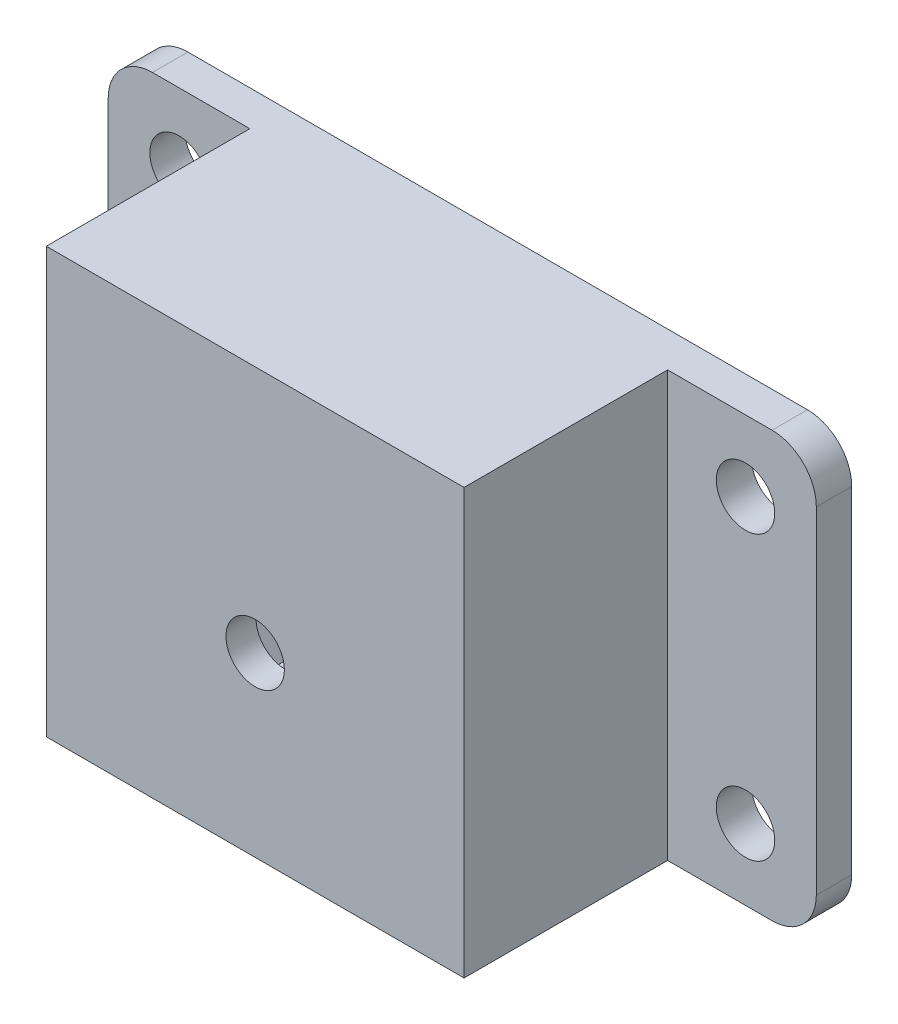
ISO-10303-21;
HEADER;
FILE_DESCRIPTION(('STEP AP214'),'2;1');
FILE_NAME('part.step','',(''),(''),'','','');
FILE_SCHEMA(('AUTOMOTIVE_DESIGN { 1 0 10303 214 1 1 1 1 }'));
ENDSEC;
DATA;
#1=APPLICATION_CONTEXT('core data for automotive mechanical design processes');
#2=APPLICATION_PROTOCOL_DEFINITION('international standard','automotive_design',2000,#1);
#3=PRODUCT_CONTEXT('',#1,'mechanical');
#4=PRODUCT('Part','Part','',(#3));
#5=PRODUCT_RELATED_PRODUCT_CATEGORY('part','',(#4));
#6=PRODUCT_DEFINITION_FORMATION('','',#4);
#7=PRODUCT_DEFINITION_CONTEXT('part definition',#1,'design');
#8=PRODUCT_DEFINITION('design','',#6,#7);
#9=PRODUCT_DEFINITION_SHAPE('','',#8);
#10=(LENGTH_UNIT() NAMED_UNIT(*) SI_UNIT(.MILLI.,.METRE.));
#11=(NAMED_UNIT(*) PLANE_ANGLE_UNIT() SI_UNIT($,.RADIAN.));
#12=(NAMED_UNIT(*) SI_UNIT($,.STERADIAN.) SOLID_ANGLE_UNIT());
#13=UNCERTAINTY_MEASURE_WITH_UNIT(LENGTH_MEASURE(1.E-05),#10,'distance_accuracy_value','');
#14=(GEOMETRIC_REPRESENTATION_CONTEXT(3) GLOBAL_UNCERTAINTY_ASSIGNED_CONTEXT((#13)) GLOBAL_UNIT_ASSIGNED_CONTEXT((#10,
#11,#12)) REPRESENTATION_CONTEXT('',''));
#15=CARTESIAN_POINT('',(0.,0.,0.));
#16=DIRECTION('',(0.,0.,1.));
#17=DIRECTION('',(1.,0.,0.));
#18=AXIS2_PLACEMENT_3D('',#15,#16,#17);
#19=CARTESIAN_POINT('',(-20.2,-14.,13.5));
#20=DIRECTION('',(0.,0.,-1.));
#21=DIRECTION('',(-1.,0.,0.));
#22=AXIS2_PLACEMENT_3D('',#19,#20,#21);
#23=CYLINDRICAL_SURFACE('',#22,1.65);
#24=CARTESIAN_POINT('',(-20.2,-14.,7.5));
#25=DIRECTION('',(0.,0.,1.));
#26=DIRECTION('',(1.,0.,0.));
#27=AXIS2_PLACEMENT_3D('',#24,#25,#26);
#28=CIRCLE('',#27,1.65);
#29=CARTESIAN_POINT('',(-18.55,-14.,7.5));
#30=VERTEX_POINT('',#29);
#31=EDGE_CURVE('E251',#30,#30,#28,.T.);
#32=ORIENTED_EDGE('',*,*,#31,.F.);
#33=EDGE_LOOP('',(#32));
#34=FACE_BOUND('',#33,.T.);
#35=CARTESIAN_POINT('',(-20.2,-14.,9.2));
#36=DIRECTION('',(0.,0.,1.));
#37=DIRECTION('',(1.,0.,0.));
#38=AXIS2_PLACEMENT_3D('',#35,#36,#37);
#39=CIRCLE('',#38,1.65);
#40=CARTESIAN_POINT('',(-18.55,-14.,9.2));
#41=VERTEX_POINT('',#40);
#42=EDGE_CURVE('E254',#41,#41,#39,.T.);
#43=ORIENTED_EDGE('',*,*,#42,.T.);
#44=EDGE_LOOP('',(#43));
#45=FACE_BOUND('',#44,.T.);
#46=ADVANCED_FACE('F39',(#34,#45),#23,.F.);
#47=CARTESIAN_POINT('',(0.,0.,2.));
#48=DIRECTION('',(0.,0.,1.));
#49=DIRECTION('',(1.,0.,0.));
#50=AXIS2_PLACEMENT_3D('',#47,#48,#49);
#51=PLANE('',#50);
#52=DIRECTION('',(-1.,0.,0.));
#53=VECTOR('',#52,1.);
#54=CARTESIAN_POINT('',(0.,0.,2.));
#55=LINE('',#54,#53);
#56=CARTESIAN_POINT('',(-32.,0.,2.));
#57=VERTEX_POINT('',#56);
#58=CARTESIAN_POINT('',(-37.5,0.,2.));
#59=VERTEX_POINT('',#58);
#60=EDGE_CURVE('E324',#57,#59,#55,.T.);
#61=ORIENTED_EDGE('',*,*,#60,.T.);
#62=CARTESIAN_POINT('',(-37.5,-2.5,2.));
#63=DIRECTION('',(0.,0.,1.));
#64=DIRECTION('',(1.,0.,0.));
#65=AXIS2_PLACEMENT_3D('',#62,#63,#64);
#66=CIRCLE('',#65,2.5);
#67=CARTESIAN_POINT('',(-40.,-2.5,2.));
#68=VERTEX_POINT('',#67);
#69=EDGE_CURVE('E11',#59,#68,#66,.T.);
#70=ORIENTED_EDGE('',*,*,#69,.T.);
#71=DIRECTION('',(0.,-1.,0.));
#72=VECTOR('',#71,1.);
#73=CARTESIAN_POINT('',(-40.,0.,2.));
#74=LINE('',#73,#72);
#75=CARTESIAN_POINT('',(-40.,-21.5,2.));
#76=VERTEX_POINT('',#75);
#77=EDGE_CURVE('E323',#68,#76,#74,.T.);
#78=ORIENTED_EDGE('',*,*,#77,.T.);
#79=CARTESIAN_POINT('',(-37.5,-21.5,2.));
#80=DIRECTION('',(0.,0.,1.));
#81=DIRECTION('',(1.,0.,0.));
#82=AXIS2_PLACEMENT_3D('',#79,#80,#81);
#83=CIRCLE('',#82,2.5);
#84=CARTESIAN_POINT('',(-37.5,-24.,2.));
#85=VERTEX_POINT('',#84);
#86=EDGE_CURVE('E47',#76,#85,#83,.T.);
#87=ORIENTED_EDGE('',*,*,#86,.T.);
#88=DIRECTION('',(1.,0.,0.));
#89=VECTOR('',#88,1.);
#90=CARTESIAN_POINT('',(-28.,-24.,2.));
#91=LINE('',#90,#89);
#92=CARTESIAN_POINT('',(-32.,-24.,2.));
#93=VERTEX_POINT('',#92);
#94=EDGE_CURVE('E326',#85,#93,#91,.T.);
#95=ORIENTED_EDGE('',*,*,#94,.T.);
#96=DIRECTION('',(0.,-1.,0.));
#97=VECTOR('',#96,1.);
#98=CARTESIAN_POINT('',(-32.,0.,2.));
#99=LINE('',#98,#97);
#100=EDGE_CURVE('E274',#57,#93,#99,.T.);
#101=ORIENTED_EDGE('',*,*,#100,.F.);
#102=EDGE_LOOP('',(#61,#70,#78,#87,#95,#101));
#103=FACE_BOUND('',#102,.T.);
#104=CARTESIAN_POINT('',(-36.,-20.,2.));
#105=DIRECTION('',(0.,0.,1.));
#106=DIRECTION('',(1.,0.,0.));
#107=AXIS2_PLACEMENT_3D('',#104,#105,#106);
#108=CIRCLE('',#107,1.65);
#109=CARTESIAN_POINT('',(-34.35,-20.,2.));
#110=VERTEX_POINT('',#109);
#111=EDGE_CURVE('E297',#110,#110,#108,.T.);
#112=ORIENTED_EDGE('',*,*,#111,.F.);
#113=EDGE_LOOP('',(#112));
#114=FACE_BOUND('',#113,.T.);
#115=CARTESIAN_POINT('',(-36.,-4.,2.));
#116=DIRECTION('',(0.,0.,1.));
#117=DIRECTION('',(1.,0.,0.));
#118=AXIS2_PLACEMENT_3D('',#115,#116,#117);
#119=CIRCLE('',#118,1.65);
#120=CARTESIAN_POINT('',(-34.35,-4.,2.));
#121=VERTEX_POINT('',#120);
#122=EDGE_CURVE('E303',#121,#121,#119,.T.);
#123=ORIENTED_EDGE('',*,*,#122,.F.);
#124=EDGE_LOOP('',(#123));
#125=FACE_BOUND('',#124,.T.);
#126=ADVANCED_FACE('F400',(#103,#114,#125),#51,.T.);
#127=DIRECTION('',(1.,0.,0.));
#128=VECTOR('',#127,1.);
#129=CARTESIAN_POINT('',(0.,-24.,2.));
#130=LINE('',#129,#128);
#131=CARTESIAN_POINT('',(-8.40000000000001,-24.,2.));
#132=VERTEX_POINT('',#131);
#133=CARTESIAN_POINT('',(-2.49999999999999,-24.,2.));
#134=VERTEX_POINT('',#133);
#135=EDGE_CURVE('E328',#132,#134,#130,.T.);
#136=ORIENTED_EDGE('',*,*,#135,.T.);
#137=CARTESIAN_POINT('',(-2.49999999999999,-21.5,2.));
#138=DIRECTION('',(0.,0.,1.));
#139=DIRECTION('',(1.,0.,0.));
#140=AXIS2_PLACEMENT_3D('',#137,#138,#139);
#141=CIRCLE('',#140,2.5);
#142=CARTESIAN_POINT('',(0.,-21.5,2.));
#143=VERTEX_POINT('',#142);
#144=EDGE_CURVE('E388',#134,#143,#141,.T.);
#145=ORIENTED_EDGE('',*,*,#144,.T.);
#146=DIRECTION('',(0.,1.,0.));
#147=VECTOR('',#146,1.);
#148=CARTESIAN_POINT('',(0.,0.,2.));
#149=LINE('',#148,#147);
#150=CARTESIAN_POINT('',(0.,-2.5,2.));
#151=VERTEX_POINT('',#150);
#152=EDGE_CURVE('E331',#143,#151,#149,.T.);
#153=ORIENTED_EDGE('',*,*,#152,.T.);
#154=CARTESIAN_POINT('',(-2.5,-2.5,2.));
#155=DIRECTION('',(0.,0.,1.));
#156=DIRECTION('',(1.,0.,0.));
#157=AXIS2_PLACEMENT_3D('',#154,#155,#156);
#158=CIRCLE('',#157,2.5);
#159=CARTESIAN_POINT('',(-2.5,0.,2.));
#160=VERTEX_POINT('',#159);
#161=EDGE_CURVE('E386',#151,#160,#158,.T.);
#162=ORIENTED_EDGE('',*,*,#161,.T.);
#163=CARTESIAN_POINT('',(-8.40000000000001,0.,2.));
#164=VERTEX_POINT('',#163);
#165=EDGE_CURVE('E321',#160,#164,#55,.T.);
#166=ORIENTED_EDGE('',*,*,#165,.T.);
#167=DIRECTION('',(0.,1.,0.));
#168=VECTOR('',#167,1.);
#169=CARTESIAN_POINT('',(-8.40000000000001,-24.,2.));
#170=LINE('',#169,#168);
#171=EDGE_CURVE('E267',#132,#164,#170,.T.);
#172=ORIENTED_EDGE('',*,*,#171,.F.);
#173=EDGE_LOOP('',(#136,#145,#153,#162,#166,#172));
#174=FACE_BOUND('',#173,.T.);
#175=CARTESIAN_POINT('',(-4.,-20.,2.));
#176=DIRECTION('',(0.,0.,1.));
#177=DIRECTION('',(1.,0.,0.));
#178=AXIS2_PLACEMENT_3D('',#175,#176,#177);
#179=CIRCLE('',#178,1.65);
#180=CARTESIAN_POINT('',(-2.35,-20.,2.));
#181=VERTEX_POINT('',#180);
#182=EDGE_CURVE('E315',#181,#181,#179,.T.);
#183=ORIENTED_EDGE('',*,*,#182,.F.);
#184=EDGE_LOOP('',(#183));
#185=FACE_BOUND('',#184,.T.);
#186=CARTESIAN_POINT('',(-4.,-4.,2.));
#187=DIRECTION('',(0.,0.,1.));
#188=DIRECTION('',(1.,0.,0.));
#189=AXIS2_PLACEMENT_3D('',#186,#187,#188);
#190=CIRCLE('',#189,1.65);
#191=CARTESIAN_POINT('',(-2.35,-4.,2.));
#192=VERTEX_POINT('',#191);
#193=EDGE_CURVE('E309',#192,#192,#190,.T.);
#194=ORIENTED_EDGE('',*,*,#193,.F.);
#195=EDGE_LOOP('',(#194));
#196=FACE_BOUND('',#195,.T.);
#197=ADVANCED_FACE('F471',(#174,#185,#196),#51,.T.);
#198=CARTESIAN_POINT('',(0.,0.,0.));
#199=DIRECTION('',(0.,0.,1.));
#200=DIRECTION('',(1.,0.,0.));
#201=AXIS2_PLACEMENT_3D('',#198,#199,#200);
#202=PLANE('',#201);
#203=DIRECTION('',(0.,1.,0.));
#204=VECTOR('',#203,1.);
#205=CARTESIAN_POINT('',(0.,0.,0.));
#206=LINE('',#205,#204);
#207=CARTESIAN_POINT('',(0.,-21.5,0.));
#208=VERTEX_POINT('',#207);
#209=CARTESIAN_POINT('',(0.,-2.5,0.));
#210=VERTEX_POINT('',#209);
#211=EDGE_CURVE('E350',#208,#210,#206,.T.);
#212=ORIENTED_EDGE('',*,*,#211,.F.);
#213=CARTESIAN_POINT('',(-2.49999999999999,-21.5,0.));
#214=DIRECTION('',(0.,0.,1.));
#215=DIRECTION('',(1.,0.,0.));
#216=AXIS2_PLACEMENT_3D('',#213,#214,#215);
#217=CIRCLE('',#216,2.5);
#218=CARTESIAN_POINT('',(-2.49999999999999,-24.,0.));
#219=VERTEX_POINT('',#218);
#220=EDGE_CURVE('E379',#208,#219,#217,.F.);
#221=ORIENTED_EDGE('',*,*,#220,.T.);
#222=DIRECTION('',(1.,0.,0.));
#223=VECTOR('',#222,1.);
#224=CARTESIAN_POINT('',(0.,-24.,0.));
#225=LINE('',#224,#223);
#226=CARTESIAN_POINT('',(-12.4,-24.,0.));
#227=VERTEX_POINT('',#226);
#228=EDGE_CURVE('E347',#227,#219,#225,.T.);
#229=ORIENTED_EDGE('',*,*,#228,.F.);
#230=DIRECTION('',(0.,-1.,0.));
#231=VECTOR('',#230,1.);
#232=CARTESIAN_POINT('',(-12.4,-24.,0.));
#233=LINE('',#232,#231);
#234=CARTESIAN_POINT('',(-12.4,-4.,0.));
#235=VERTEX_POINT('',#234);
#236=EDGE_CURVE('E345',#235,#227,#233,.T.);
#237=ORIENTED_EDGE('',*,*,#236,.F.);
#238=DIRECTION('',(1.,0.,0.));
#239=VECTOR('',#238,1.);
#240=CARTESIAN_POINT('',(-12.4,-4.,0.));
#241=LINE('',#240,#239);
#242=CARTESIAN_POINT('',(-28.,-4.,0.));
#243=VERTEX_POINT('',#242);
#244=EDGE_CURVE('E343',#243,#235,#241,.T.);
#245=ORIENTED_EDGE('',*,*,#244,.F.);
#246=DIRECTION('',(0.,1.,0.));
#247=VECTOR('',#246,1.);
#248=CARTESIAN_POINT('',(-28.,-4.,0.));
#249=LINE('',#248,#247);
#250=CARTESIAN_POINT('',(-28.,-24.,0.));
#251=VERTEX_POINT('',#250);
#252=EDGE_CURVE('E341',#251,#243,#249,.T.);
#253=ORIENTED_EDGE('',*,*,#252,.F.);
#254=DIRECTION('',(1.,0.,0.));
#255=VECTOR('',#254,1.);
#256=CARTESIAN_POINT('',(-28.,-24.,0.));
#257=LINE('',#256,#255);
#258=CARTESIAN_POINT('',(-37.5,-24.,0.));
#259=VERTEX_POINT('',#258);
#260=EDGE_CURVE('E339',#259,#251,#257,.T.);
#261=ORIENTED_EDGE('',*,*,#260,.F.);
#262=CARTESIAN_POINT('',(-37.5,-21.5,0.));
#263=DIRECTION('',(0.,0.,1.));
#264=DIRECTION('',(1.,0.,0.));
#265=AXIS2_PLACEMENT_3D('',#262,#263,#264);
#266=CIRCLE('',#265,2.5);
#267=CARTESIAN_POINT('',(-40.,-21.5,0.));
#268=VERTEX_POINT('',#267);
#269=EDGE_CURVE('E373',#259,#268,#266,.F.);
#270=ORIENTED_EDGE('',*,*,#269,.T.);
#271=DIRECTION('',(0.,-1.,0.));
#272=VECTOR('',#271,1.);
#273=CARTESIAN_POINT('',(-40.,0.,0.));
#274=LINE('',#273,#272);
#275=CARTESIAN_POINT('',(-40.,-2.5,0.));
#276=VERTEX_POINT('',#275);
#277=EDGE_CURVE('E337',#276,#268,#274,.T.);
#278=ORIENTED_EDGE('',*,*,#277,.F.);
#279=CARTESIAN_POINT('',(-37.5,-2.5,0.));
#280=DIRECTION('',(0.,0.,1.));
#281=DIRECTION('',(1.,0.,0.));
#282=AXIS2_PLACEMENT_3D('',#279,#280,#281);
#283=CIRCLE('',#282,2.5);
#284=CARTESIAN_POINT('',(-37.5,0.,0.));
#285=VERTEX_POINT('',#284);
#286=EDGE_CURVE('E375',#276,#285,#283,.F.);
#287=ORIENTED_EDGE('',*,*,#286,.T.);
#288=DIRECTION('',(-1.,0.,0.));
#289=VECTOR('',#288,1.);
#290=CARTESIAN_POINT('',(0.,0.,0.));
#291=LINE('',#290,#289);
#292=CARTESIAN_POINT('',(-2.5,0.,0.));
#293=VERTEX_POINT('',#292);
#294=EDGE_CURVE('E318',#293,#285,#291,.T.);
#295=ORIENTED_EDGE('',*,*,#294,.F.);
#296=CARTESIAN_POINT('',(-2.5,-2.5,0.));
#297=DIRECTION('',(0.,0.,1.));
#298=DIRECTION('',(1.,0.,0.));
#299=AXIS2_PLACEMENT_3D('',#296,#297,#298);
#300=CIRCLE('',#299,2.5);
#301=EDGE_CURVE('E377',#293,#210,#300,.F.);
#302=ORIENTED_EDGE('',*,*,#301,.T.);
#303=EDGE_LOOP('',(#212,#221,#229,#237,#245,#253,#261,#270,#278,#287,#295,#302));
#304=FACE_BOUND('',#303,.T.);
#305=CARTESIAN_POINT('',(-4.,-20.,0.));
#306=DIRECTION('',(0.,0.,1.));
#307=DIRECTION('',(1.,0.,0.));
#308=AXIS2_PLACEMENT_3D('',#305,#306,#307);
#309=CIRCLE('',#308,1.65);
#310=CARTESIAN_POINT('',(-2.35,-20.,0.));
#311=VERTEX_POINT('',#310);
#312=EDGE_CURVE('E312',#311,#311,#309,.T.);
#313=ORIENTED_EDGE('',*,*,#312,.T.);
#314=EDGE_LOOP('',(#313));
#315=FACE_BOUND('',#314,.T.);
#316=CARTESIAN_POINT('',(-4.,-4.,0.));
#317=DIRECTION('',(0.,0.,1.));
#318=DIRECTION('',(1.,0.,0.));
#319=AXIS2_PLACEMENT_3D('',#316,#317,#318);
#320=CIRCLE('',#319,1.65);
#321=CARTESIAN_POINT('',(-2.35,-4.,0.));
#322=VERTEX_POINT('',#321);
#323=EDGE_CURVE('E306',#322,#322,#320,.T.);
#324=ORIENTED_EDGE('',*,*,#323,.T.);
#325=EDGE_LOOP('',(#324));
#326=FACE_BOUND('',#325,.T.);
#327=CARTESIAN_POINT('',(-36.,-4.,0.));
#328=DIRECTION('',(0.,0.,1.));
#329=DIRECTION('',(1.,0.,0.));
#330=AXIS2_PLACEMENT_3D('',#327,#328,#329);
#331=CIRCLE('',#330,1.65);
#332=CARTESIAN_POINT('',(-34.35,-4.,0.));
#333=VERTEX_POINT('',#332);
#334=EDGE_CURVE('E300',#333,#333,#331,.T.);
#335=ORIENTED_EDGE('',*,*,#334,.T.);
#336=EDGE_LOOP('',(#335));
#337=FACE_BOUND('',#336,.T.);
#338=CARTESIAN_POINT('',(-36.,-20.,0.));
#339=DIRECTION('',(0.,0.,1.));
#340=DIRECTION('',(1.,0.,0.));
#341=AXIS2_PLACEMENT_3D('',#338,#339,#340);
#342=CIRCLE('',#341,1.65);
#343=CARTESIAN_POINT('',(-34.35,-20.,0.));
#344=VERTEX_POINT('',#343);
#345=EDGE_CURVE('E296',#344,#344,#342,.T.);
#346=ORIENTED_EDGE('',*,*,#345,.T.);
#347=EDGE_LOOP('',(#346));
#348=FACE_BOUND('',#347,.T.);
#349=ADVANCED_FACE('F411',(#304,#315,#326,#337,#348),#202,.F.);
#350=CARTESIAN_POINT('',(0.,0.,2.));
#351=DIRECTION('',(0.,-1.,0.));
#352=DIRECTION('',(0.,0.,-1.));
#353=AXIS2_PLACEMENT_3D('',#350,#351,#352);
#354=PLANE('',#353);
#355=ORIENTED_EDGE('',*,*,#165,.F.);
#356=DIRECTION('',(0.,0.,-1.));
#357=VECTOR('',#356,1.);
#358=CARTESIAN_POINT('',(-2.5,0.,2.));
#359=LINE('',#358,#357);
#360=EDGE_CURVE('E392',#160,#293,#359,.T.);
#361=ORIENTED_EDGE('',*,*,#360,.T.);
#362=ORIENTED_EDGE('',*,*,#294,.T.);
#363=DIRECTION('',(0.,0.,-1.));
#364=VECTOR('',#363,1.);
#365=CARTESIAN_POINT('',(-37.5,0.,2.));
#366=LINE('',#365,#364);
#367=EDGE_CURVE('E390',#285,#59,#366,.F.);
#368=ORIENTED_EDGE('',*,*,#367,.T.);
#369=ORIENTED_EDGE('',*,*,#60,.F.);
#370=DIRECTION('',(0.,0.,-1.));
#371=VECTOR('',#370,1.);
#372=CARTESIAN_POINT('',(-32.,0.,7.5));
#373=LINE('',#372,#371);
#374=CARTESIAN_POINT('',(-32.,0.,13.5));
#375=VERTEX_POINT('',#374);
#376=EDGE_CURVE('E287',#375,#57,#373,.T.);
#377=ORIENTED_EDGE('',*,*,#376,.F.);
#378=DIRECTION('',(-1.,0.,0.));
#379=VECTOR('',#378,1.);
#380=CARTESIAN_POINT('',(-32.,0.,13.5));
#381=LINE('',#380,#379);
#382=CARTESIAN_POINT('',(-8.40000000000001,0.,13.5));
#383=VERTEX_POINT('',#382);
#384=EDGE_CURVE('E264',#383,#375,#381,.T.);
#385=ORIENTED_EDGE('',*,*,#384,.F.);
#386=DIRECTION('',(0.,0.,-1.));
#387=VECTOR('',#386,1.);
#388=CARTESIAN_POINT('',(-8.40000000000001,0.,7.5));
#389=LINE('',#388,#387);
#390=EDGE_CURVE('E290',#383,#164,#389,.T.);
#391=ORIENTED_EDGE('',*,*,#390,.T.);
#392=EDGE_LOOP('',(#355,#361,#362,#368,#369,#377,#385,#391));
#393=FACE_BOUND('',#392,.T.);
#394=ADVANCED_FACE('F422',(#393),#354,.F.);
#395=CARTESIAN_POINT('',(-40.,0.,2.));
#396=DIRECTION('',(1.,0.,0.));
#397=DIRECTION('',(0.,1.,0.));
#398=AXIS2_PLACEMENT_3D('',#395,#396,#397);
#399=PLANE('',#398);
#400=ORIENTED_EDGE('',*,*,#77,.F.);
#401=DIRECTION('',(0.,0.,-1.));
#402=VECTOR('',#401,1.);
#403=CARTESIAN_POINT('',(-40.,-2.5,2.));
#404=LINE('',#403,#402);
#405=EDGE_CURVE('E396',#68,#276,#404,.T.);
#406=ORIENTED_EDGE('',*,*,#405,.T.);
#407=ORIENTED_EDGE('',*,*,#277,.T.);
#408=DIRECTION('',(0.,0.,-1.));
#409=VECTOR('',#408,1.);
#410=CARTESIAN_POINT('',(-40.,-21.5,2.));
#411=LINE('',#410,#409);
#412=EDGE_CURVE('E54',#268,#76,#411,.F.);
#413=ORIENTED_EDGE('',*,*,#412,.T.);
#414=EDGE_LOOP('',(#400,#406,#407,#413));
#415=FACE_BOUND('',#414,.T.);
#416=ADVANCED_FACE('F414',(#415),#399,.F.);
#417=CARTESIAN_POINT('',(-28.,-4.,2.));
#418=DIRECTION('',(-1.,0.,0.));
#419=DIRECTION('',(0.,-1.,0.));
#420=AXIS2_PLACEMENT_3D('',#417,#418,#419);
#421=PLANE('',#420);
#422=ORIENTED_EDGE('',*,*,#252,.T.);
#423=DIRECTION('',(0.,0.,-1.));
#424=VECTOR('',#423,1.);
#425=CARTESIAN_POINT('',(-28.,-4.,2.));
#426=LINE('',#425,#424);
#427=CARTESIAN_POINT('',(-28.,-4.,7.5));
#428=VERTEX_POINT('',#427);
#429=EDGE_CURVE('E358',#428,#243,#426,.T.);
#430=ORIENTED_EDGE('',*,*,#429,.F.);
#431=DIRECTION('',(0.,1.,0.));
#432=VECTOR('',#431,1.);
#433=CARTESIAN_POINT('',(-28.,-24.,7.5));
#434=LINE('',#433,#432);
#435=CARTESIAN_POINT('',(-28.,-24.,7.5));
#436=VERTEX_POINT('',#435);
#437=EDGE_CURVE('E270',#436,#428,#434,.T.);
#438=ORIENTED_EDGE('',*,*,#437,.F.);
#439=DIRECTION('',(0.,0.,-1.));
#440=VECTOR('',#439,1.);
#441=CARTESIAN_POINT('',(-28.,-24.,2.));
#442=LINE('',#441,#440);
#443=EDGE_CURVE('E361',#436,#251,#442,.T.);
#444=ORIENTED_EDGE('',*,*,#443,.T.);
#445=EDGE_LOOP('',(#422,#430,#438,#444));
#446=FACE_BOUND('',#445,.T.);
#447=ADVANCED_FACE('F452',(#446),#421,.F.);
#448=CARTESIAN_POINT('',(-12.4,-4.,2.));
#449=DIRECTION('',(0.,1.,0.));
#450=DIRECTION('',(0.,0.,1.));
#451=AXIS2_PLACEMENT_3D('',#448,#449,#450);
#452=PLANE('',#451);
#453=ORIENTED_EDGE('',*,*,#244,.T.);
#454=DIRECTION('',(0.,0.,-1.));
#455=VECTOR('',#454,1.);
#456=CARTESIAN_POINT('',(-12.4,-4.,2.));
#457=LINE('',#456,#455);
#458=CARTESIAN_POINT('',(-12.4,-4.,7.5));
#459=VERTEX_POINT('',#458);
#460=EDGE_CURVE('E355',#459,#235,#457,.T.);
#461=ORIENTED_EDGE('',*,*,#460,.F.);
#462=DIRECTION('',(1.,0.,0.));
#463=VECTOR('',#462,1.);
#464=CARTESIAN_POINT('',(-28.,-4.,7.5));
#465=LINE('',#464,#463);
#466=EDGE_CURVE('E273',#428,#459,#465,.T.);
#467=ORIENTED_EDGE('',*,*,#466,.F.);
#468=ORIENTED_EDGE('',*,*,#429,.T.);
#469=EDGE_LOOP('',(#453,#461,#467,#468));
#470=FACE_BOUND('',#469,.T.);
#471=ADVANCED_FACE('F449',(#470),#452,.F.);
#472=CARTESIAN_POINT('',(-12.4,-24.,2.));
#473=DIRECTION('',(1.,0.,0.));
#474=DIRECTION('',(0.,1.,0.));
#475=AXIS2_PLACEMENT_3D('',#472,#473,#474);
#476=PLANE('',#475);
#477=ORIENTED_EDGE('',*,*,#236,.T.);
#478=DIRECTION('',(0.,0.,-1.));
#479=VECTOR('',#478,1.);
#480=CARTESIAN_POINT('',(-12.4,-24.,2.));
#481=LINE('',#480,#479);
#482=CARTESIAN_POINT('',(-12.4,-24.,7.5));
#483=VERTEX_POINT('',#482);
#484=EDGE_CURVE('E334',#483,#227,#481,.T.);
#485=ORIENTED_EDGE('',*,*,#484,.F.);
#486=DIRECTION('',(0.,-1.,0.));
#487=VECTOR('',#486,1.);
#488=CARTESIAN_POINT('',(-12.4,-4.,7.5));
#489=LINE('',#488,#487);
#490=EDGE_CURVE('E277',#459,#483,#489,.T.);
#491=ORIENTED_EDGE('',*,*,#490,.F.);
#492=ORIENTED_EDGE('',*,*,#460,.T.);
#493=EDGE_LOOP('',(#477,#485,#491,#492));
#494=FACE_BOUND('',#493,.T.);
#495=ADVANCED_FACE('F443',(#494),#476,.F.);
#496=CARTESIAN_POINT('',(0.,-24.,2.));
#497=DIRECTION('',(0.,1.,0.));
#498=DIRECTION('',(0.,0.,1.));
#499=AXIS2_PLACEMENT_3D('',#496,#497,#498);
#500=PLANE('',#499);
#501=ORIENTED_EDGE('',*,*,#228,.T.);
#502=DIRECTION('',(0.,0.,-1.));
#503=VECTOR('',#502,1.);
#504=CARTESIAN_POINT('',(-2.49999999999999,-24.,2.));
#505=LINE('',#504,#503);
#506=EDGE_CURVE('E384',#219,#134,#505,.F.);
#507=ORIENTED_EDGE('',*,*,#506,.T.);
#508=ORIENTED_EDGE('',*,*,#135,.F.);
#509=DIRECTION('',(0.,0.,-1.));
#510=VECTOR('',#509,1.);
#511=CARTESIAN_POINT('',(-8.40000000000001,-24.,7.5));
#512=LINE('',#511,#510);
#513=CARTESIAN_POINT('',(-8.40000000000001,-24.,13.5));
#514=VERTEX_POINT('',#513);
#515=EDGE_CURVE('E293',#514,#132,#512,.T.);
#516=ORIENTED_EDGE('',*,*,#515,.F.);
#517=DIRECTION('',(1.,0.,0.));
#518=VECTOR('',#517,1.);
#519=CARTESIAN_POINT('',(-32.,-24.,13.5));
#520=LINE('',#519,#518);
#521=CARTESIAN_POINT('',(-32.,-24.,13.5));
#522=VERTEX_POINT('',#521);
#523=EDGE_CURVE('E258',#522,#514,#520,.T.);
#524=ORIENTED_EDGE('',*,*,#523,.F.);
#525=DIRECTION('',(0.,0.,-1.));
#526=VECTOR('',#525,1.);
#527=CARTESIAN_POINT('',(-32.,-24.,7.5));
#528=LINE('',#527,#526);
#529=EDGE_CURVE('E280',#522,#93,#528,.T.);
#530=ORIENTED_EDGE('',*,*,#529,.T.);
#531=ORIENTED_EDGE('',*,*,#94,.F.);
#532=DIRECTION('',(0.,0.,-1.));
#533=VECTOR('',#532,1.);
#534=CARTESIAN_POINT('',(-37.5,-24.,2.));
#535=LINE('',#534,#533);
#536=EDGE_CURVE('E381',#85,#259,#535,.T.);
#537=ORIENTED_EDGE('',*,*,#536,.T.);
#538=ORIENTED_EDGE('',*,*,#260,.T.);
#539=ORIENTED_EDGE('',*,*,#443,.F.);
#540=DIRECTION('',(1.,0.,0.));
#541=VECTOR('',#540,1.);
#542=CARTESIAN_POINT('',(-32.,-24.,7.5));
#543=LINE('',#542,#541);
#544=EDGE_CURVE('E250',#436,#483,#543,.T.);
#545=ORIENTED_EDGE('',*,*,#544,.T.);
#546=ORIENTED_EDGE('',*,*,#484,.T.);
#547=EDGE_LOOP('',(#501,#507,#508,#516,#524,#530,#531,#537,#538,#539,#545,#546));
#548=FACE_BOUND('',#547,.T.);
#549=ADVANCED_FACE('F405',(#548),#500,.F.);
#550=CARTESIAN_POINT('',(0.,0.,2.));
#551=DIRECTION('',(-1.,0.,0.));
#552=DIRECTION('',(0.,-1.,0.));
#553=AXIS2_PLACEMENT_3D('',#550,#551,#552);
#554=PLANE('',#553);
#555=ORIENTED_EDGE('',*,*,#152,.F.);
#556=DIRECTION('',(0.,0.,-1.));
#557=VECTOR('',#556,1.);
#558=CARTESIAN_POINT('',(0.,-21.5,2.));
#559=LINE('',#558,#557);
#560=EDGE_CURVE('E370',#143,#208,#559,.T.);
#561=ORIENTED_EDGE('',*,*,#560,.T.);
#562=ORIENTED_EDGE('',*,*,#211,.T.);
#563=DIRECTION('',(0.,0.,-1.));
#564=VECTOR('',#563,1.);
#565=CARTESIAN_POINT('',(0.,-2.5,2.));
#566=LINE('',#565,#564);
#567=EDGE_CURVE('E364',#210,#151,#566,.F.);
#568=ORIENTED_EDGE('',*,*,#567,.T.);
#569=EDGE_LOOP('',(#555,#561,#562,#568));
#570=FACE_BOUND('',#569,.T.);
#571=ADVANCED_FACE('F431',(#570),#554,.F.);
#572=CARTESIAN_POINT('',(-4.,-20.,2.));
#573=DIRECTION('',(0.,0.,-1.));
#574=DIRECTION('',(-1.,0.,0.));
#575=AXIS2_PLACEMENT_3D('',#572,#573,#574);
#576=CYLINDRICAL_SURFACE('',#575,1.65);
#577=ORIENTED_EDGE('',*,*,#182,.T.);
#578=EDGE_LOOP('',(#577));
#579=FACE_BOUND('',#578,.T.);
#580=ORIENTED_EDGE('',*,*,#312,.F.);
#581=EDGE_LOOP('',(#580));
#582=FACE_BOUND('',#581,.T.);
#583=ADVANCED_FACE('F581',(#579,#582),#576,.F.);
#584=CARTESIAN_POINT('',(-4.,-4.,2.));
#585=DIRECTION('',(0.,0.,-1.));
#586=DIRECTION('',(-1.,0.,0.));
#587=AXIS2_PLACEMENT_3D('',#584,#585,#586);
#588=CYLINDRICAL_SURFACE('',#587,1.65);
#589=ORIENTED_EDGE('',*,*,#193,.T.);
#590=EDGE_LOOP('',(#589));
#591=FACE_BOUND('',#590,.T.);
#592=ORIENTED_EDGE('',*,*,#323,.F.);
#593=EDGE_LOOP('',(#592));
#594=FACE_BOUND('',#593,.T.);
#595=ADVANCED_FACE('F741',(#591,#594),#588,.F.);
#596=CARTESIAN_POINT('',(-36.,-4.,2.));
#597=DIRECTION('',(0.,0.,-1.));
#598=DIRECTION('',(-1.,0.,0.));
#599=AXIS2_PLACEMENT_3D('',#596,#597,#598);
#600=CYLINDRICAL_SURFACE('',#599,1.65);
#601=ORIENTED_EDGE('',*,*,#122,.T.);
#602=EDGE_LOOP('',(#601));
#603=FACE_BOUND('',#602,.T.);
#604=ORIENTED_EDGE('',*,*,#334,.F.);
#605=EDGE_LOOP('',(#604));
#606=FACE_BOUND('',#605,.T.);
#607=ADVANCED_FACE('F731',(#603,#606),#600,.F.);
#608=CARTESIAN_POINT('',(-36.,-20.,2.));
#609=DIRECTION('',(0.,0.,-1.));
#610=DIRECTION('',(-1.,0.,0.));
#611=AXIS2_PLACEMENT_3D('',#608,#609,#610);
#612=CYLINDRICAL_SURFACE('',#611,1.65);
#613=ORIENTED_EDGE('',*,*,#111,.T.);
#614=EDGE_LOOP('',(#613));
#615=FACE_BOUND('',#614,.T.);
#616=ORIENTED_EDGE('',*,*,#345,.F.);
#617=EDGE_LOOP('',(#616));
#618=FACE_BOUND('',#617,.T.);
#619=ADVANCED_FACE('F682',(#615,#618),#612,.F.);
#620=CARTESIAN_POINT('',(-8.40000000000001,-24.,7.5));
#621=DIRECTION('',(-1.,0.,0.));
#622=DIRECTION('',(0.,0.,1.));
#623=AXIS2_PLACEMENT_3D('',#620,#621,#622);
#624=PLANE('',#623);
#625=ORIENTED_EDGE('',*,*,#171,.T.);
#626=ORIENTED_EDGE('',*,*,#390,.F.);
#627=DIRECTION('',(0.,1.,0.));
#628=VECTOR('',#627,1.);
#629=CARTESIAN_POINT('',(-8.40000000000001,0.,13.5));
#630=LINE('',#629,#628);
#631=EDGE_CURVE('E261',#514,#383,#630,.T.);
#632=ORIENTED_EDGE('',*,*,#631,.F.);
#633=ORIENTED_EDGE('',*,*,#515,.T.);
#634=EDGE_LOOP('',(#625,#626,#632,#633));
#635=FACE_BOUND('',#634,.T.);
#636=ADVANCED_FACE('F673',(#635),#624,.F.);
#637=CARTESIAN_POINT('',(-32.,0.,7.5));
#638=DIRECTION('',(1.,0.,0.));
#639=DIRECTION('',(0.,0.,-1.));
#640=AXIS2_PLACEMENT_3D('',#637,#638,#639);
#641=PLANE('',#640);
#642=ORIENTED_EDGE('',*,*,#100,.T.);
#643=ORIENTED_EDGE('',*,*,#529,.F.);
#644=DIRECTION('',(0.,-1.,0.));
#645=VECTOR('',#644,1.);
#646=CARTESIAN_POINT('',(-32.,0.,13.5));
#647=LINE('',#646,#645);
#648=EDGE_CURVE('E255',#375,#522,#647,.T.);
#649=ORIENTED_EDGE('',*,*,#648,.F.);
#650=ORIENTED_EDGE('',*,*,#376,.T.);
#651=EDGE_LOOP('',(#642,#643,#649,#650));
#652=FACE_BOUND('',#651,.T.);
#653=ADVANCED_FACE('F664',(#652),#641,.F.);
#654=CARTESIAN_POINT('',(0.,0.,7.5));
#655=DIRECTION('',(0.,0.,1.));
#656=DIRECTION('',(1.,0.,0.));
#657=AXIS2_PLACEMENT_3D('',#654,#655,#656);
#658=PLANE('',#657);
#659=ORIENTED_EDGE('',*,*,#31,.T.);
#660=EDGE_LOOP('',(#659));
#661=FACE_BOUND('',#660,.T.);
#662=ORIENTED_EDGE('',*,*,#544,.F.);
#663=ORIENTED_EDGE('',*,*,#437,.T.);
#664=ORIENTED_EDGE('',*,*,#466,.T.);
#665=ORIENTED_EDGE('',*,*,#490,.T.);
#666=EDGE_LOOP('',(#662,#663,#664,#665));
#667=FACE_BOUND('',#666,.T.);
#668=ADVANCED_FACE('F445',(#661,#667),#658,.F.);
#669=CARTESIAN_POINT('',(0.,0.,13.5));
#670=DIRECTION('',(0.,0.,1.));
#671=DIRECTION('',(1.,0.,0.));
#672=AXIS2_PLACEMENT_3D('',#669,#670,#671);
#673=PLANE('',#672);
#674=ORIENTED_EDGE('',*,*,#648,.T.);
#675=ORIENTED_EDGE('',*,*,#523,.T.);
#676=ORIENTED_EDGE('',*,*,#631,.T.);
#677=ORIENTED_EDGE('',*,*,#384,.T.);
#678=EDGE_LOOP('',(#674,#675,#676,#677));
#679=FACE_BOUND('',#678,.T.);
#680=CARTESIAN_POINT('',(-20.2,-14.,13.5));
#681=DIRECTION('',(0.,0.,1.));
#682=DIRECTION('',(1.,0.,0.));
#683=AXIS2_PLACEMENT_3D('',#680,#681,#682);
#684=CIRCLE('',#683,1.65);
#685=CARTESIAN_POINT('',(-18.55,-14.,13.5));
#686=VERTEX_POINT('',#685);
#687=EDGE_CURVE('E247',#686,#686,#684,.T.);
#688=ORIENTED_EDGE('',*,*,#687,.F.);
#689=EDGE_LOOP('',(#688));
#690=FACE_BOUND('',#689,.T.);
#691=ADVANCED_FACE('F477',(#679,#690),#673,.T.);
#692=CARTESIAN_POINT('',(-20.2,-14.,11.8));
#693=DIRECTION('',(0.,0.,1.));
#694=DIRECTION('',(1.,0.,0.));
#695=AXIS2_PLACEMENT_3D('',#692,#693,#694);
#696=CIRCLE('',#695,1.65);
#697=CARTESIAN_POINT('',(-18.55,-14.,11.8));
#698=VERTEX_POINT('',#697);
#699=EDGE_CURVE('E239',#698,#698,#696,.T.);
#700=ORIENTED_EDGE('',*,*,#699,.F.);
#701=EDGE_LOOP('',(#700));
#702=FACE_BOUND('',#701,.T.);
#703=ORIENTED_EDGE('',*,*,#687,.T.);
#704=EDGE_LOOP('',(#703));
#705=FACE_BOUND('',#704,.T.);
#706=ADVANCED_FACE('F465',(#702,#705),#23,.F.);
#707=CARTESIAN_POINT('',(-18.5256842193501,-16.9,9.2));
#708=DIRECTION('',(0.866025403784439,-0.5,0.));
#709=DIRECTION('',(0.5,0.866025403784439,0.));
#710=AXIS2_PLACEMENT_3D('',#707,#708,#709);
#711=PLANE('',#710);
#712=DIRECTION('',(0.5,0.866025403784439,0.));
#713=VECTOR('',#712,1.);
#714=CARTESIAN_POINT('',(-18.5256842193501,-16.9,11.8));
#715=LINE('',#714,#713);
#716=CARTESIAN_POINT('',(-18.5256842193501,-16.9,11.8));
#717=VERTEX_POINT('',#716);
#718=CARTESIAN_POINT('',(-16.8513684387002,-14.,11.8));
#719=VERTEX_POINT('',#718);
#720=EDGE_CURVE('E195',#717,#719,#715,.T.);
#721=ORIENTED_EDGE('',*,*,#720,.T.);
#722=DIRECTION('',(0.,0.,1.));
#723=VECTOR('',#722,1.);
#724=CARTESIAN_POINT('',(-16.8513684387002,-14.,9.2));
#725=LINE('',#724,#723);
#726=CARTESIAN_POINT('',(-16.8513684387002,-14.,9.2));
#727=VERTEX_POINT('',#726);
#728=EDGE_CURVE('E188',#727,#719,#725,.T.);
#729=ORIENTED_EDGE('',*,*,#728,.F.);
#730=DIRECTION('',(0.5,0.866025403784439,0.));
#731=VECTOR('',#730,1.);
#732=CARTESIAN_POINT('',(-18.5256842193501,-16.9,9.2));
#733=LINE('',#732,#731);
#734=CARTESIAN_POINT('',(-18.5256842193501,-16.9,9.2));
#735=VERTEX_POINT('',#734);
#736=EDGE_CURVE('E192',#735,#727,#733,.T.);
#737=ORIENTED_EDGE('',*,*,#736,.F.);
#738=DIRECTION('',(0.,0.,1.));
#739=VECTOR('',#738,1.);
#740=CARTESIAN_POINT('',(-18.5256842193501,-16.9,9.2));
#741=LINE('',#740,#739);
#742=EDGE_CURVE('E237',#735,#717,#741,.T.);
#743=ORIENTED_EDGE('',*,*,#742,.T.);
#744=EDGE_LOOP('',(#721,#729,#737,#743));
#745=FACE_BOUND('',#744,.T.);
#746=ADVANCED_FACE('F190',(#745),#711,.F.);
#747=CARTESIAN_POINT('',(-21.8743157806499,-16.9,9.2));
#748=DIRECTION('',(0.,-1.,0.));
#749=DIRECTION('',(0.,0.,-1.));
#750=AXIS2_PLACEMENT_3D('',#747,#748,#749);
#751=PLANE('',#750);
#752=DIRECTION('',(1.,0.,0.));
#753=VECTOR('',#752,1.);
#754=CARTESIAN_POINT('',(-21.8743157806499,-16.9,11.8));
#755=LINE('',#754,#753);
#756=CARTESIAN_POINT('',(-21.8743157806499,-16.9,11.8));
#757=VERTEX_POINT('',#756);
#758=EDGE_CURVE('E213',#757,#717,#755,.T.);
#759=ORIENTED_EDGE('',*,*,#758,.T.);
#760=ORIENTED_EDGE('',*,*,#742,.F.);
#761=DIRECTION('',(1.,0.,0.));
#762=VECTOR('',#761,1.);
#763=CARTESIAN_POINT('',(-21.8743157806499,-16.9,9.2));
#764=LINE('',#763,#762);
#765=CARTESIAN_POINT('',(-21.8743157806499,-16.9,9.2));
#766=VERTEX_POINT('',#765);
#767=EDGE_CURVE('E200',#766,#735,#764,.T.);
#768=ORIENTED_EDGE('',*,*,#767,.F.);
#769=DIRECTION('',(0.,0.,1.));
#770=VECTOR('',#769,1.);
#771=CARTESIAN_POINT('',(-21.8743157806499,-16.9,9.2));
#772=LINE('',#771,#770);
#773=EDGE_CURVE('E240',#766,#757,#772,.T.);
#774=ORIENTED_EDGE('',*,*,#773,.T.);
#775=EDGE_LOOP('',(#759,#760,#768,#774));
#776=FACE_BOUND('',#775,.T.);
#777=ADVANCED_FACE('F482',(#776),#751,.F.);
#778=CARTESIAN_POINT('',(-23.5486315612998,-14.,9.2));
#779=DIRECTION('',(-0.866025403784438,-0.500000000000001,0.));
#780=DIRECTION('',(0.500000000000001,-0.866025403784438,0.));
#781=AXIS2_PLACEMENT_3D('',#778,#779,#780);
#782=PLANE('',#781);
#783=DIRECTION('',(0.5,-0.866025403784438,0.));
#784=VECTOR('',#783,1.);
#785=CARTESIAN_POINT('',(-23.5486315612998,-14.,11.8));
#786=LINE('',#785,#784);
#787=CARTESIAN_POINT('',(-23.5486315612998,-14.,11.8));
#788=VERTEX_POINT('',#787);
#789=EDGE_CURVE('E216',#788,#757,#786,.T.);
#790=ORIENTED_EDGE('',*,*,#789,.T.);
#791=ORIENTED_EDGE('',*,*,#773,.F.);
#792=DIRECTION('',(0.5,-0.866025403784438,0.));
#793=VECTOR('',#792,1.);
#794=CARTESIAN_POINT('',(-23.5486315612998,-14.,9.2));
#795=LINE('',#794,#793);
#796=CARTESIAN_POINT('',(-23.5486315612998,-14.,9.2));
#797=VERTEX_POINT('',#796);
#798=EDGE_CURVE('E223',#797,#766,#795,.T.);
#799=ORIENTED_EDGE('',*,*,#798,.F.);
#800=DIRECTION('',(0.,0.,1.));
#801=VECTOR('',#800,1.);
#802=CARTESIAN_POINT('',(-23.5486315612998,-14.,9.2));
#803=LINE('',#802,#801);
#804=EDGE_CURVE('E242',#797,#788,#803,.T.);
#805=ORIENTED_EDGE('',*,*,#804,.T.);
#806=EDGE_LOOP('',(#790,#791,#799,#805));
#807=FACE_BOUND('',#806,.T.);
#808=ADVANCED_FACE('F499',(#807),#782,.F.);
#809=CARTESIAN_POINT('',(-21.8743157806499,-11.1,9.2));
#810=DIRECTION('',(-0.866025403784439,0.5,0.));
#811=DIRECTION('',(-0.5,-0.866025403784439,0.));
#812=AXIS2_PLACEMENT_3D('',#809,#810,#811);
#813=PLANE('',#812);
#814=DIRECTION('',(-0.5,-0.866025403784439,0.));
#815=VECTOR('',#814,1.);
#816=CARTESIAN_POINT('',(-21.8743157806499,-11.1,11.8));
#817=LINE('',#816,#815);
#818=CARTESIAN_POINT('',(-21.8743157806499,-11.1,11.8));
#819=VERTEX_POINT('',#818);
#820=EDGE_CURVE('E232',#819,#788,#817,.T.);
#821=ORIENTED_EDGE('',*,*,#820,.T.);
#822=ORIENTED_EDGE('',*,*,#804,.F.);
#823=DIRECTION('',(-0.5,-0.866025403784439,0.));
#824=VECTOR('',#823,1.);
#825=CARTESIAN_POINT('',(-21.8743157806499,-11.1,9.2));
#826=LINE('',#825,#824);
#827=CARTESIAN_POINT('',(-21.8743157806499,-11.1,9.2));
#828=VERTEX_POINT('',#827);
#829=EDGE_CURVE('E220',#828,#797,#826,.T.);
#830=ORIENTED_EDGE('',*,*,#829,.F.);
#831=DIRECTION('',(0.,0.,1.));
#832=VECTOR('',#831,1.);
#833=CARTESIAN_POINT('',(-21.8743157806499,-11.1,9.2));
#834=LINE('',#833,#832);
#835=EDGE_CURVE('E244',#828,#819,#834,.T.);
#836=ORIENTED_EDGE('',*,*,#835,.T.);
#837=EDGE_LOOP('',(#821,#822,#830,#836));
#838=FACE_BOUND('',#837,.T.);
#839=ADVANCED_FACE('F502',(#838),#813,.F.);
#840=CARTESIAN_POINT('',(-18.5256842193501,-11.1,9.2));
#841=DIRECTION('',(0.,1.,0.));
#842=DIRECTION('',(0.,0.,1.));
#843=AXIS2_PLACEMENT_3D('',#840,#841,#842);
#844=PLANE('',#843);
#845=DIRECTION('',(-1.,0.,0.));
#846=VECTOR('',#845,1.);
#847=CARTESIAN_POINT('',(-18.5256842193501,-11.1,11.8));
#848=LINE('',#847,#846);
#849=CARTESIAN_POINT('',(-18.5256842193501,-11.1,11.8));
#850=VERTEX_POINT('',#849);
#851=EDGE_CURVE('E229',#850,#819,#848,.T.);
#852=ORIENTED_EDGE('',*,*,#851,.T.);
#853=ORIENTED_EDGE('',*,*,#835,.F.);
#854=DIRECTION('',(-1.,0.,0.));
#855=VECTOR('',#854,1.);
#856=CARTESIAN_POINT('',(-18.5256842193501,-11.1,9.2));
#857=LINE('',#856,#855);
#858=CARTESIAN_POINT('',(-18.5256842193501,-11.1,9.2));
#859=VERTEX_POINT('',#858);
#860=EDGE_CURVE('E208',#859,#828,#857,.T.);
#861=ORIENTED_EDGE('',*,*,#860,.F.);
#862=DIRECTION('',(0.,0.,1.));
#863=VECTOR('',#862,1.);
#864=CARTESIAN_POINT('',(-18.5256842193501,-11.1,9.2));
#865=LINE('',#864,#863);
#866=EDGE_CURVE('E199',#859,#850,#865,.T.);
#867=ORIENTED_EDGE('',*,*,#866,.T.);
#868=EDGE_LOOP('',(#852,#853,#861,#867));
#869=FACE_BOUND('',#868,.T.);
#870=ADVANCED_FACE('F505',(#869),#844,.F.);
#871=CARTESIAN_POINT('',(-16.8513684387002,-14.,9.2));
#872=DIRECTION('',(0.866025403784438,0.5,0.));
#873=DIRECTION('',(-0.5,0.866025403784438,0.));
#874=AXIS2_PLACEMENT_3D('',#871,#872,#873);
#875=PLANE('',#874);
#876=DIRECTION('',(-0.5,0.866025403784438,0.));
#877=VECTOR('',#876,1.);
#878=CARTESIAN_POINT('',(-16.8513684387002,-14.,11.8));
#879=LINE('',#878,#877);
#880=EDGE_CURVE('E227',#719,#850,#879,.T.);
#881=ORIENTED_EDGE('',*,*,#880,.T.);
#882=ORIENTED_EDGE('',*,*,#866,.F.);
#883=DIRECTION('',(-0.5,0.866025403784438,0.));
#884=VECTOR('',#883,1.);
#885=CARTESIAN_POINT('',(-16.8513684387002,-14.,9.2));
#886=LINE('',#885,#884);
#887=EDGE_CURVE('E203',#727,#859,#886,.T.);
#888=ORIENTED_EDGE('',*,*,#887,.F.);
#889=ORIENTED_EDGE('',*,*,#728,.T.);
#890=EDGE_LOOP('',(#881,#882,#888,#889));
#891=FACE_BOUND('',#890,.T.);
#892=ADVANCED_FACE('F204',(#891),#875,.F.);
#893=CARTESIAN_POINT('',(0.,0.,9.2));
#894=DIRECTION('',(0.,0.,1.));
#895=DIRECTION('',(1.,0.,0.));
#896=AXIS2_PLACEMENT_3D('',#893,#894,#895);
#897=PLANE('',#896);
#898=ORIENTED_EDGE('',*,*,#42,.F.);
#899=EDGE_LOOP('',(#898));
#900=FACE_BOUND('',#899,.T.);
#901=ORIENTED_EDGE('',*,*,#736,.T.);
#902=ORIENTED_EDGE('',*,*,#887,.T.);
#903=ORIENTED_EDGE('',*,*,#860,.T.);
#904=ORIENTED_EDGE('',*,*,#829,.T.);
#905=ORIENTED_EDGE('',*,*,#798,.T.);
#906=ORIENTED_EDGE('',*,*,#767,.T.);
#907=EDGE_LOOP('',(#901,#902,#903,#904,#905,#906));
#908=FACE_BOUND('',#907,.T.);
#909=ADVANCED_FACE('F210',(#900,#908),#897,.T.);
#910=CARTESIAN_POINT('',(0.,0.,11.8));
#911=DIRECTION('',(0.,0.,1.));
#912=DIRECTION('',(1.,0.,0.));
#913=AXIS2_PLACEMENT_3D('',#910,#911,#912);
#914=PLANE('',#913);
#915=ORIENTED_EDGE('',*,*,#699,.T.);
#916=EDGE_LOOP('',(#915));
#917=FACE_BOUND('',#916,.T.);
#918=ORIENTED_EDGE('',*,*,#720,.F.);
#919=ORIENTED_EDGE('',*,*,#758,.F.);
#920=ORIENTED_EDGE('',*,*,#789,.F.);
#921=ORIENTED_EDGE('',*,*,#820,.F.);
#922=ORIENTED_EDGE('',*,*,#851,.F.);
#923=ORIENTED_EDGE('',*,*,#880,.F.);
#924=EDGE_LOOP('',(#918,#919,#920,#921,#922,#923));
#925=FACE_BOUND('',#924,.T.);
#926=ADVANCED_FACE('F489',(#917,#925),#914,.F.);
#927=CARTESIAN_POINT('',(-2.49999999999999,-21.5,2.));
#928=DIRECTION('',(0.,0.,-1.));
#929=DIRECTION('',(-1.,0.,0.));
#930=AXIS2_PLACEMENT_3D('',#927,#928,#929);
#931=CYLINDRICAL_SURFACE('',#930,2.5);
#932=ORIENTED_EDGE('',*,*,#144,.F.);
#933=ORIENTED_EDGE('',*,*,#506,.F.);
#934=ORIENTED_EDGE('',*,*,#220,.F.);
#935=ORIENTED_EDGE('',*,*,#560,.F.);
#936=EDGE_LOOP('',(#932,#933,#934,#935));
#937=FACE_BOUND('',#936,.T.);
#938=ADVANCED_FACE('F435',(#937),#931,.T.);
#939=CARTESIAN_POINT('',(-2.5,-2.5,2.));
#940=DIRECTION('',(0.,0.,-1.));
#941=DIRECTION('',(-1.,0.,0.));
#942=AXIS2_PLACEMENT_3D('',#939,#940,#941);
#943=CYLINDRICAL_SURFACE('',#942,2.5);
#944=ORIENTED_EDGE('',*,*,#161,.F.);
#945=ORIENTED_EDGE('',*,*,#567,.F.);
#946=ORIENTED_EDGE('',*,*,#301,.F.);
#947=ORIENTED_EDGE('',*,*,#360,.F.);
#948=EDGE_LOOP('',(#944,#945,#946,#947));
#949=FACE_BOUND('',#948,.T.);
#950=ADVANCED_FACE('F427',(#949),#943,.T.);
#951=CARTESIAN_POINT('',(-37.5,-2.5,2.));
#952=DIRECTION('',(0.,0.,-1.));
#953=DIRECTION('',(-1.,0.,0.));
#954=AXIS2_PLACEMENT_3D('',#951,#952,#953);
#955=CYLINDRICAL_SURFACE('',#954,2.5);
#956=ORIENTED_EDGE('',*,*,#69,.F.);
#957=ORIENTED_EDGE('',*,*,#367,.F.);
#958=ORIENTED_EDGE('',*,*,#286,.F.);
#959=ORIENTED_EDGE('',*,*,#405,.F.);
#960=EDGE_LOOP('',(#956,#957,#958,#959));
#961=FACE_BOUND('',#960,.T.);
#962=ADVANCED_FACE('F417',(#961),#955,.T.);
#963=CARTESIAN_POINT('',(-37.5,-21.5,2.));
#964=DIRECTION('',(0.,0.,-1.));
#965=DIRECTION('',(-1.,0.,0.));
#966=AXIS2_PLACEMENT_3D('',#963,#964,#965);
#967=CYLINDRICAL_SURFACE('',#966,2.5);
#968=ORIENTED_EDGE('',*,*,#86,.F.);
#969=ORIENTED_EDGE('',*,*,#412,.F.);
#970=ORIENTED_EDGE('',*,*,#269,.F.);
#971=ORIENTED_EDGE('',*,*,#536,.F.);
#972=EDGE_LOOP('',(#968,#969,#970,#971));
#973=FACE_BOUND('',#972,.T.);
#974=ADVANCED_FACE('F41',(#973),#967,.T.);
#975=CLOSED_SHELL('',(#46,#126,#197,#349,#394,#416,#447,#471,#495,#549,#571,#583,#595,#607,#619,
#636,#653,#668,#691,#706,#746,#777,#808,#839,#870,#892,#909,#926,#938,#950,#962,#974));
#976=MANIFOLD_SOLID_BREP('B2',#975);
#977=ADVANCED_BREP_SHAPE_REPRESENTATION('',(#18,#976),#14);
#978=SHAPE_DEFINITION_REPRESENTATION(#9,#977);
ENDSEC;
END-ISO-10303-21;
